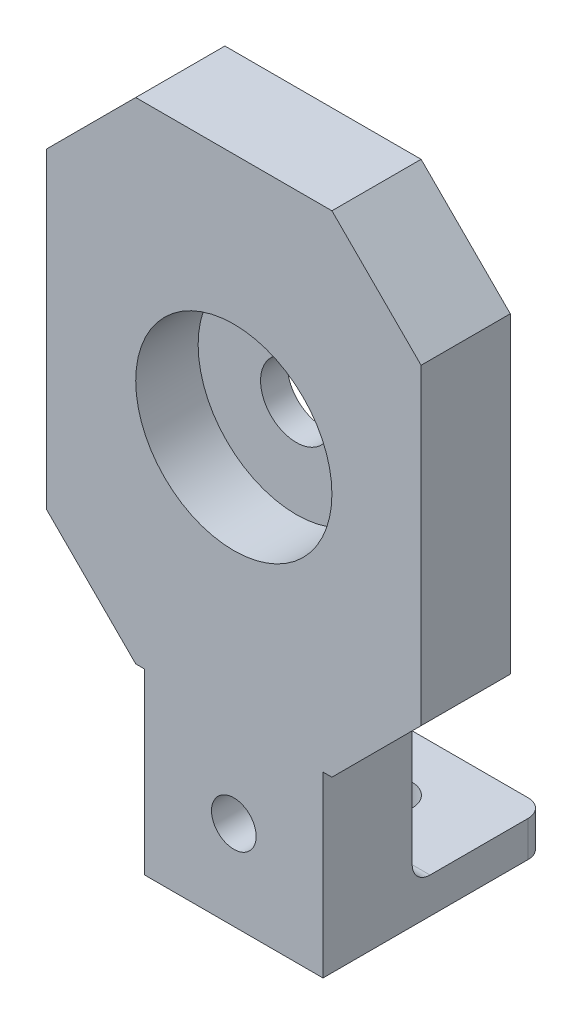
ISO-10303-21;
HEADER;
FILE_DESCRIPTION(('STEP AP214'),'2;1');
FILE_NAME('part.step','',(''),(''),'','','');
FILE_SCHEMA(('AUTOMOTIVE_DESIGN { 1 0 10303 214 1 1 1 1 }'));
ENDSEC;
DATA;
#1=APPLICATION_CONTEXT('core data for automotive mechanical design processes');
#2=APPLICATION_PROTOCOL_DEFINITION('international standard','automotive_design',2000,#1);
#3=PRODUCT_CONTEXT('',#1,'mechanical');
#4=PRODUCT('Part','Part','',(#3));
#5=PRODUCT_RELATED_PRODUCT_CATEGORY('part','',(#4));
#6=PRODUCT_DEFINITION_FORMATION('','',#4);
#7=PRODUCT_DEFINITION_CONTEXT('part definition',#1,'design');
#8=PRODUCT_DEFINITION('design','',#6,#7);
#9=PRODUCT_DEFINITION_SHAPE('','',#8);
#10=(LENGTH_UNIT() NAMED_UNIT(*) SI_UNIT(.MILLI.,.METRE.));
#11=(NAMED_UNIT(*) PLANE_ANGLE_UNIT() SI_UNIT($,.RADIAN.));
#12=(NAMED_UNIT(*) SI_UNIT($,.STERADIAN.) SOLID_ANGLE_UNIT());
#13=UNCERTAINTY_MEASURE_WITH_UNIT(LENGTH_MEASURE(1.E-05),#10,'distance_accuracy_value','');
#14=(GEOMETRIC_REPRESENTATION_CONTEXT(3) GLOBAL_UNCERTAINTY_ASSIGNED_CONTEXT((#13)) GLOBAL_UNIT_ASSIGNED_CONTEXT((#10,
#11,#12)) REPRESENTATION_CONTEXT('',''));
#15=CARTESIAN_POINT('',(0.,0.,0.));
#16=DIRECTION('',(0.,0.,1.));
#17=DIRECTION('',(1.,0.,0.));
#18=AXIS2_PLACEMENT_3D('',#15,#16,#17);
#19=CARTESIAN_POINT('',(21.,-27.5,10.));
#20=DIRECTION('',(-1.,0.,0.));
#21=DIRECTION('',(0.,-1.,0.));
#22=AXIS2_PLACEMENT_3D('',#19,#20,#21);
#23=PLANE('',#22);
#24=DIRECTION('',(0.,1.,0.));
#25=VECTOR('',#24,1.);
#26=CARTESIAN_POINT('',(21.,-27.5,10.));
#27=LINE('',#26,#25);
#28=CARTESIAN_POINT('',(21.,-17.5,10.));
#29=VERTEX_POINT('',#28);
#30=CARTESIAN_POINT('',(21.,17.5,10.));
#31=VERTEX_POINT('',#30);
#32=EDGE_CURVE('E209',#29,#31,#27,.T.);
#33=ORIENTED_EDGE('',*,*,#32,.F.);
#34=DIRECTION('',(0.,0.,-1.));
#35=VECTOR('',#34,1.);
#36=CARTESIAN_POINT('',(21.,-17.5,10.));
#37=LINE('',#36,#35);
#38=CARTESIAN_POINT('',(21.,-17.5,0.));
#39=VERTEX_POINT('',#38);
#40=EDGE_CURVE('E238',#29,#39,#37,.T.);
#41=ORIENTED_EDGE('',*,*,#40,.T.);
#42=DIRECTION('',(0.,1.,0.));
#43=VECTOR('',#42,1.);
#44=CARTESIAN_POINT('',(21.,-27.5,0.));
#45=LINE('',#44,#43);
#46=CARTESIAN_POINT('',(21.,17.5,0.));
#47=VERTEX_POINT('',#46);
#48=EDGE_CURVE('E191',#39,#47,#45,.T.);
#49=ORIENTED_EDGE('',*,*,#48,.T.);
#50=DIRECTION('',(0.,0.,1.));
#51=VECTOR('',#50,1.);
#52=CARTESIAN_POINT('',(21.,17.5,10.));
#53=LINE('',#52,#51);
#54=EDGE_CURVE('E236',#47,#31,#53,.T.);
#55=ORIENTED_EDGE('',*,*,#54,.T.);
#56=EDGE_LOOP('',(#33,#41,#49,#55));
#57=FACE_BOUND('',#56,.T.);
#58=ADVANCED_FACE('F35',(#57),#23,.F.);
#59=CARTESIAN_POINT('',(-21.,27.5,10.));
#60=DIRECTION('',(0.,-1.,0.));
#61=DIRECTION('',(1.,0.,0.));
#62=AXIS2_PLACEMENT_3D('',#59,#60,#61);
#63=PLANE('',#62);
#64=DIRECTION('',(-1.,0.,0.));
#65=VECTOR('',#64,1.);
#66=CARTESIAN_POINT('',(-21.,27.5,10.));
#67=LINE('',#66,#65);
#68=CARTESIAN_POINT('',(11.,27.5,10.));
#69=VERTEX_POINT('',#68);
#70=CARTESIAN_POINT('',(-11.,27.5,10.));
#71=VERTEX_POINT('',#70);
#72=EDGE_CURVE('E307',#69,#71,#67,.T.);
#73=ORIENTED_EDGE('',*,*,#72,.F.);
#74=DIRECTION('',(0.,0.,-1.));
#75=VECTOR('',#74,1.);
#76=CARTESIAN_POINT('',(11.,27.5,10.));
#77=LINE('',#76,#75);
#78=CARTESIAN_POINT('',(11.,27.5,0.));
#79=VERTEX_POINT('',#78);
#80=EDGE_CURVE('E245',#69,#79,#77,.T.);
#81=ORIENTED_EDGE('',*,*,#80,.T.);
#82=DIRECTION('',(-1.,0.,0.));
#83=VECTOR('',#82,1.);
#84=CARTESIAN_POINT('',(-21.,27.5,0.));
#85=LINE('',#84,#83);
#86=CARTESIAN_POINT('',(-11.,27.5,0.));
#87=VERTEX_POINT('',#86);
#88=EDGE_CURVE('E194',#79,#87,#85,.T.);
#89=ORIENTED_EDGE('',*,*,#88,.T.);
#90=DIRECTION('',(0.,0.,1.));
#91=VECTOR('',#90,1.);
#92=CARTESIAN_POINT('',(-11.,27.5,10.));
#93=LINE('',#92,#91);
#94=EDGE_CURVE('E243',#87,#71,#93,.T.);
#95=ORIENTED_EDGE('',*,*,#94,.T.);
#96=EDGE_LOOP('',(#73,#81,#89,#95));
#97=FACE_BOUND('',#96,.T.);
#98=ADVANCED_FACE('F324',(#97),#63,.F.);
#99=CARTESIAN_POINT('',(-21.,-27.5,10.));
#100=DIRECTION('',(1.,0.,0.));
#101=DIRECTION('',(0.,0.,-1.));
#102=AXIS2_PLACEMENT_3D('',#99,#100,#101);
#103=PLANE('',#102);
#104=DIRECTION('',(0.,-1.,0.));
#105=VECTOR('',#104,1.);
#106=CARTESIAN_POINT('',(-21.,-27.5,0.));
#107=LINE('',#106,#105);
#108=CARTESIAN_POINT('',(-21.,17.5,0.));
#109=VERTEX_POINT('',#108);
#110=CARTESIAN_POINT('',(-21.,-17.5,0.));
#111=VERTEX_POINT('',#110);
#112=EDGE_CURVE('E198',#109,#111,#107,.T.);
#113=ORIENTED_EDGE('',*,*,#112,.T.);
#114=DIRECTION('',(0.,0.,1.));
#115=VECTOR('',#114,1.);
#116=CARTESIAN_POINT('',(-21.,-17.5,10.));
#117=LINE('',#116,#115);
#118=CARTESIAN_POINT('',(-21.,-17.5,10.));
#119=VERTEX_POINT('',#118);
#120=EDGE_CURVE('E227',#111,#119,#117,.T.);
#121=ORIENTED_EDGE('',*,*,#120,.T.);
#122=DIRECTION('',(0.,-1.,0.));
#123=VECTOR('',#122,1.);
#124=CARTESIAN_POINT('',(-21.,-27.5,10.));
#125=LINE('',#124,#123);
#126=CARTESIAN_POINT('',(-21.,17.5,10.));
#127=VERTEX_POINT('',#126);
#128=EDGE_CURVE('E166',#127,#119,#125,.T.);
#129=ORIENTED_EDGE('',*,*,#128,.F.);
#130=DIRECTION('',(0.,0.,-1.));
#131=VECTOR('',#130,1.);
#132=CARTESIAN_POINT('',(-21.,17.5,10.));
#133=LINE('',#132,#131);
#134=EDGE_CURVE('E224',#127,#109,#133,.T.);
#135=ORIENTED_EDGE('',*,*,#134,.T.);
#136=EDGE_LOOP('',(#113,#121,#129,#135));
#137=FACE_BOUND('',#136,.T.);
#138=ADVANCED_FACE('F317',(#137),#103,.F.);
#139=CARTESIAN_POINT('',(-9.99999999999999,-27.5,10.));
#140=DIRECTION('',(0.,1.,0.));
#141=DIRECTION('',(0.,0.,1.));
#142=AXIS2_PLACEMENT_3D('',#139,#140,#141);
#143=PLANE('',#142);
#144=DIRECTION('',(1.,0.,0.));
#145=VECTOR('',#144,1.);
#146=CARTESIAN_POINT('',(-9.99999999999999,-27.5,10.));
#147=LINE('',#146,#145);
#148=CARTESIAN_POINT('',(-11.,-27.5,10.));
#149=VERTEX_POINT('',#148);
#150=CARTESIAN_POINT('',(-9.99999999999999,-27.5,10.));
#151=VERTEX_POINT('',#150);
#152=EDGE_CURVE('E155',#149,#151,#147,.T.);
#153=ORIENTED_EDGE('',*,*,#152,.F.);
#154=DIRECTION('',(0.,0.,-1.));
#155=VECTOR('',#154,1.);
#156=CARTESIAN_POINT('',(-11.,-27.5,10.));
#157=LINE('',#156,#155);
#158=CARTESIAN_POINT('',(-11.,-27.5,0.));
#159=VERTEX_POINT('',#158);
#160=EDGE_CURVE('E175',#149,#159,#157,.T.);
#161=ORIENTED_EDGE('',*,*,#160,.T.);
#162=DIRECTION('',(1.,0.,0.));
#163=VECTOR('',#162,1.);
#164=CARTESIAN_POINT('',(-9.99999999999999,-27.5,0.));
#165=LINE('',#164,#163);
#166=CARTESIAN_POINT('',(-9.99999999999999,-27.5,0.));
#167=VERTEX_POINT('',#166);
#168=EDGE_CURVE('E172',#159,#167,#165,.T.);
#169=ORIENTED_EDGE('',*,*,#168,.T.);
#170=DIRECTION('',(0.,0.,-1.));
#171=VECTOR('',#170,1.);
#172=CARTESIAN_POINT('',(-9.99999999999999,-27.5,10.));
#173=LINE('',#172,#171);
#174=EDGE_CURVE('E169',#151,#167,#173,.T.);
#175=ORIENTED_EDGE('',*,*,#174,.F.);
#176=EDGE_LOOP('',(#153,#161,#169,#175));
#177=FACE_BOUND('',#176,.T.);
#178=ADVANCED_FACE('F170',(#177),#143,.F.);
#179=CARTESIAN_POINT('',(-10.,-47.5,10.));
#180=DIRECTION('',(1.,0.,0.));
#181=DIRECTION('',(0.,1.,0.));
#182=AXIS2_PLACEMENT_3D('',#179,#180,#181);
#183=PLANE('',#182);
#184=DIRECTION('',(0.,0.,1.));
#185=VECTOR('',#184,1.);
#186=CARTESIAN_POINT('',(-9.99999999999999,-43.5,-15.));
#187=LINE('',#186,#185);
#188=CARTESIAN_POINT('',(-9.99999999999999,-43.5,-13.));
#189=VERTEX_POINT('',#188);
#190=CARTESIAN_POINT('',(-9.99999999999999,-43.5,-2.));
#191=VERTEX_POINT('',#190);
#192=EDGE_CURVE('E285',#189,#191,#187,.T.);
#193=ORIENTED_EDGE('',*,*,#192,.F.);
#194=DIRECTION('',(0.,1.,0.));
#195=VECTOR('',#194,1.);
#196=CARTESIAN_POINT('',(-10.,-47.5,-13.));
#197=LINE('',#196,#195);
#198=CARTESIAN_POINT('',(-10.,-47.5,-13.));
#199=VERTEX_POINT('',#198);
#200=EDGE_CURVE('E58',#189,#199,#197,.F.);
#201=ORIENTED_EDGE('',*,*,#200,.T.);
#202=DIRECTION('',(0.,0.,-1.));
#203=VECTOR('',#202,1.);
#204=CARTESIAN_POINT('',(-10.,-47.5,10.));
#205=LINE('',#204,#203);
#206=CARTESIAN_POINT('',(-10.,-47.5,10.));
#207=VERTEX_POINT('',#206);
#208=EDGE_CURVE('E176',#207,#199,#205,.T.);
#209=ORIENTED_EDGE('',*,*,#208,.F.);
#210=DIRECTION('',(0.,-1.,0.));
#211=VECTOR('',#210,1.);
#212=CARTESIAN_POINT('',(-10.,-47.5,10.));
#213=LINE('',#212,#211);
#214=EDGE_CURVE('E160',#151,#207,#213,.T.);
#215=ORIENTED_EDGE('',*,*,#214,.F.);
#216=ORIENTED_EDGE('',*,*,#174,.T.);
#217=DIRECTION('',(0.,-1.,0.));
#218=VECTOR('',#217,1.);
#219=CARTESIAN_POINT('',(-10.,-47.5,0.));
#220=LINE('',#219,#218);
#221=CARTESIAN_POINT('',(-10.,-41.5,0.));
#222=VERTEX_POINT('',#221);
#223=EDGE_CURVE('E202',#167,#222,#220,.T.);
#224=ORIENTED_EDGE('',*,*,#223,.T.);
#225=CARTESIAN_POINT('',(-10.,-41.5,-2.));
#226=DIRECTION('',(1.,0.,0.));
#227=DIRECTION('',(0.,1.,0.));
#228=AXIS2_PLACEMENT_3D('',#225,#226,#227);
#229=CIRCLE('',#228,2.);
#230=EDGE_CURVE('E11',#222,#191,#229,.T.);
#231=ORIENTED_EDGE('',*,*,#230,.T.);
#232=EDGE_LOOP('',(#193,#201,#209,#215,#216,#224,#231));
#233=FACE_BOUND('',#232,.T.);
#234=ADVANCED_FACE('F178',(#233),#183,.F.);
#235=CARTESIAN_POINT('',(-10.,-47.5,10.));
#236=DIRECTION('',(0.,1.,0.));
#237=DIRECTION('',(0.,0.,1.));
#238=AXIS2_PLACEMENT_3D('',#235,#236,#237);
#239=PLANE('',#238);
#240=CARTESIAN_POINT('',(0.,-47.5,-7.5));
#241=DIRECTION('',(0.,1.,0.));
#242=DIRECTION('',(0.,0.,1.));
#243=AXIS2_PLACEMENT_3D('',#240,#241,#242);
#244=CIRCLE('',#243,2.5);
#245=CARTESIAN_POINT('',(0.,-47.5,-5.));
#246=VERTEX_POINT('',#245);
#247=EDGE_CURVE('E401',#246,#246,#244,.T.);
#248=ORIENTED_EDGE('',*,*,#247,.T.);
#249=EDGE_LOOP('',(#248));
#250=FACE_BOUND('',#249,.T.);
#251=ORIENTED_EDGE('',*,*,#208,.T.);
#252=CARTESIAN_POINT('',(-8.,-47.5,-13.));
#253=DIRECTION('',(0.,1.,0.));
#254=DIRECTION('',(0.,0.,1.));
#255=AXIS2_PLACEMENT_3D('',#252,#253,#254);
#256=CIRCLE('',#255,2.);
#257=CARTESIAN_POINT('',(-7.99999999999999,-47.5,-15.));
#258=VERTEX_POINT('',#257);
#259=EDGE_CURVE('E265',#199,#258,#256,.F.);
#260=ORIENTED_EDGE('',*,*,#259,.T.);
#261=DIRECTION('',(-1.,0.,0.));
#262=VECTOR('',#261,1.);
#263=CARTESIAN_POINT('',(10.,-47.5,-15.));
#264=LINE('',#263,#262);
#265=CARTESIAN_POINT('',(8.00000000000001,-47.5,-15.));
#266=VERTEX_POINT('',#265);
#267=EDGE_CURVE('E396',#266,#258,#264,.T.);
#268=ORIENTED_EDGE('',*,*,#267,.F.);
#269=CARTESIAN_POINT('',(8.00000000000001,-47.5,-13.));
#270=DIRECTION('',(0.,1.,0.));
#271=DIRECTION('',(0.,0.,1.));
#272=AXIS2_PLACEMENT_3D('',#269,#270,#271);
#273=CIRCLE('',#272,2.);
#274=CARTESIAN_POINT('',(10.,-47.5,-13.));
#275=VERTEX_POINT('',#274);
#276=EDGE_CURVE('E50',#266,#275,#273,.F.);
#277=ORIENTED_EDGE('',*,*,#276,.T.);
#278=DIRECTION('',(0.,0.,-1.));
#279=VECTOR('',#278,1.);
#280=CARTESIAN_POINT('',(10.,-47.5,10.));
#281=LINE('',#280,#279);
#282=CARTESIAN_POINT('',(10.,-47.5,10.));
#283=VERTEX_POINT('',#282);
#284=EDGE_CURVE('E212',#283,#275,#281,.T.);
#285=ORIENTED_EDGE('',*,*,#284,.F.);
#286=DIRECTION('',(1.,0.,0.));
#287=VECTOR('',#286,1.);
#288=CARTESIAN_POINT('',(-10.,-47.5,10.));
#289=LINE('',#288,#287);
#290=EDGE_CURVE('E180',#207,#283,#289,.T.);
#291=ORIENTED_EDGE('',*,*,#290,.F.);
#292=EDGE_LOOP('',(#251,#260,#268,#277,#285,#291));
#293=FACE_BOUND('',#292,.T.);
#294=ADVANCED_FACE('F343',(#250,#293),#239,.F.);
#295=CARTESIAN_POINT('',(10.,-47.5,10.));
#296=DIRECTION('',(-1.,0.,0.));
#297=DIRECTION('',(0.,-1.,0.));
#298=AXIS2_PLACEMENT_3D('',#295,#296,#297);
#299=PLANE('',#298);
#300=ORIENTED_EDGE('',*,*,#284,.T.);
#301=DIRECTION('',(0.,-1.,0.));
#302=VECTOR('',#301,1.);
#303=CARTESIAN_POINT('',(10.,-47.5,-13.));
#304=LINE('',#303,#302);
#305=CARTESIAN_POINT('',(10.,-43.5,-13.));
#306=VERTEX_POINT('',#305);
#307=EDGE_CURVE('E267',#275,#306,#304,.F.);
#308=ORIENTED_EDGE('',*,*,#307,.T.);
#309=DIRECTION('',(0.,0.,1.));
#310=VECTOR('',#309,1.);
#311=CARTESIAN_POINT('',(10.,-43.5,-15.));
#312=LINE('',#311,#310);
#313=CARTESIAN_POINT('',(10.,-43.5,-2.));
#314=VERTEX_POINT('',#313);
#315=EDGE_CURVE('E274',#306,#314,#312,.T.);
#316=ORIENTED_EDGE('',*,*,#315,.T.);
#317=CARTESIAN_POINT('',(10.,-41.5,-2.));
#318=DIRECTION('',(-1.,0.,0.));
#319=DIRECTION('',(0.,-1.,0.));
#320=AXIS2_PLACEMENT_3D('',#317,#318,#319);
#321=CIRCLE('',#320,2.);
#322=CARTESIAN_POINT('',(10.,-41.5,0.));
#323=VERTEX_POINT('',#322);
#324=EDGE_CURVE('E43',#314,#323,#321,.T.);
#325=ORIENTED_EDGE('',*,*,#324,.T.);
#326=DIRECTION('',(0.,1.,0.));
#327=VECTOR('',#326,1.);
#328=CARTESIAN_POINT('',(10.,-47.5,0.));
#329=LINE('',#328,#327);
#330=CARTESIAN_POINT('',(10.,-27.5,0.));
#331=VERTEX_POINT('',#330);
#332=EDGE_CURVE('E204',#323,#331,#329,.T.);
#333=ORIENTED_EDGE('',*,*,#332,.T.);
#334=DIRECTION('',(0.,0.,-1.));
#335=VECTOR('',#334,1.);
#336=CARTESIAN_POINT('',(10.,-27.5,10.));
#337=LINE('',#336,#335);
#338=CARTESIAN_POINT('',(10.,-27.5,10.));
#339=VERTEX_POINT('',#338);
#340=EDGE_CURVE('E190',#339,#331,#337,.T.);
#341=ORIENTED_EDGE('',*,*,#340,.F.);
#342=DIRECTION('',(0.,1.,0.));
#343=VECTOR('',#342,1.);
#344=CARTESIAN_POINT('',(10.,-47.5,10.));
#345=LINE('',#344,#343);
#346=EDGE_CURVE('E182',#283,#339,#345,.T.);
#347=ORIENTED_EDGE('',*,*,#346,.F.);
#348=EDGE_LOOP('',(#300,#308,#316,#325,#333,#341,#347));
#349=FACE_BOUND('',#348,.T.);
#350=ADVANCED_FACE('F271',(#349),#299,.F.);
#351=CARTESIAN_POINT('',(10.,-27.5,10.));
#352=DIRECTION('',(0.,1.,0.));
#353=DIRECTION('',(0.,0.,1.));
#354=AXIS2_PLACEMENT_3D('',#351,#352,#353);
#355=PLANE('',#354);
#356=DIRECTION('',(1.,0.,0.));
#357=VECTOR('',#356,1.);
#358=CARTESIAN_POINT('',(10.,-27.5,0.));
#359=LINE('',#358,#357);
#360=CARTESIAN_POINT('',(11.,-27.5,0.));
#361=VERTEX_POINT('',#360);
#362=EDGE_CURVE('E206',#331,#361,#359,.T.);
#363=ORIENTED_EDGE('',*,*,#362,.T.);
#364=DIRECTION('',(0.,0.,1.));
#365=VECTOR('',#364,1.);
#366=CARTESIAN_POINT('',(11.,-27.5,10.));
#367=LINE('',#366,#365);
#368=CARTESIAN_POINT('',(11.,-27.5,10.));
#369=VERTEX_POINT('',#368);
#370=EDGE_CURVE('E241',#361,#369,#367,.T.);
#371=ORIENTED_EDGE('',*,*,#370,.T.);
#372=DIRECTION('',(1.,0.,0.));
#373=VECTOR('',#372,1.);
#374=CARTESIAN_POINT('',(10.,-27.5,10.));
#375=LINE('',#374,#373);
#376=EDGE_CURVE('E187',#339,#369,#375,.T.);
#377=ORIENTED_EDGE('',*,*,#376,.F.);
#378=ORIENTED_EDGE('',*,*,#340,.T.);
#379=EDGE_LOOP('',(#363,#371,#377,#378));
#380=FACE_BOUND('',#379,.T.);
#381=ADVANCED_FACE('F339',(#380),#355,.F.);
#382=CARTESIAN_POINT('',(0.,0.,10.));
#383=DIRECTION('',(0.,0.,-1.));
#384=DIRECTION('',(-1.,0.,0.));
#385=AXIS2_PLACEMENT_3D('',#382,#383,#384);
#386=PLANE('',#385);
#387=CARTESIAN_POINT('',(0.,-37.5,10.));
#388=DIRECTION('',(0.,0.,-1.));
#389=DIRECTION('',(-1.,0.,0.));
#390=AXIS2_PLACEMENT_3D('',#387,#388,#389);
#391=CIRCLE('',#390,2.5);
#392=CARTESIAN_POINT('',(-2.5,-37.5,10.));
#393=VERTEX_POINT('',#392);
#394=EDGE_CURVE('E408',#393,#393,#391,.T.);
#395=ORIENTED_EDGE('',*,*,#394,.T.);
#396=EDGE_LOOP('',(#395));
#397=FACE_BOUND('',#396,.T.);
#398=CARTESIAN_POINT('',(0.,0.,10.));
#399=DIRECTION('',(0.,0.,1.));
#400=DIRECTION('',(1.,0.,0.));
#401=AXIS2_PLACEMENT_3D('',#398,#399,#400);
#402=CIRCLE('',#401,11.);
#403=CARTESIAN_POINT('',(11.,0.,10.));
#404=VERTEX_POINT('',#403);
#405=EDGE_CURVE('E299',#404,#404,#402,.T.);
#406=ORIENTED_EDGE('',*,*,#405,.F.);
#407=EDGE_LOOP('',(#406));
#408=FACE_BOUND('',#407,.T.);
#409=ORIENTED_EDGE('',*,*,#128,.T.);
#410=DIRECTION('',(-0.707106781186546,0.707106781186549,0.));
#411=VECTOR('',#410,1.);
#412=CARTESIAN_POINT('',(-11.,-27.5,10.));
#413=LINE('',#412,#411);
#414=EDGE_CURVE('E162',#119,#149,#413,.F.);
#415=ORIENTED_EDGE('',*,*,#414,.T.);
#416=ORIENTED_EDGE('',*,*,#152,.T.);
#417=ORIENTED_EDGE('',*,*,#214,.T.);
#418=ORIENTED_EDGE('',*,*,#290,.T.);
#419=ORIENTED_EDGE('',*,*,#346,.T.);
#420=ORIENTED_EDGE('',*,*,#376,.T.);
#421=DIRECTION('',(-0.707106781186548,-0.707106781186547,0.));
#422=VECTOR('',#421,1.);
#423=CARTESIAN_POINT('',(21.,-17.5,10.));
#424=LINE('',#423,#422);
#425=EDGE_CURVE('E233',#369,#29,#424,.F.);
#426=ORIENTED_EDGE('',*,*,#425,.T.);
#427=ORIENTED_EDGE('',*,*,#32,.T.);
#428=DIRECTION('',(0.707106781186547,-0.707106781186548,0.));
#429=VECTOR('',#428,1.);
#430=CARTESIAN_POINT('',(11.,27.5,10.));
#431=LINE('',#430,#429);
#432=EDGE_CURVE('E231',#31,#69,#431,.F.);
#433=ORIENTED_EDGE('',*,*,#432,.T.);
#434=ORIENTED_EDGE('',*,*,#72,.T.);
#435=DIRECTION('',(0.707106781186549,0.707106781186546,0.));
#436=VECTOR('',#435,1.);
#437=CARTESIAN_POINT('',(-21.,17.5,10.));
#438=LINE('',#437,#436);
#439=EDGE_CURVE('E229',#71,#127,#438,.F.);
#440=ORIENTED_EDGE('',*,*,#439,.T.);
#441=EDGE_LOOP('',(#409,#415,#416,#417,#418,#419,#420,#426,#427,#433,#434,#440));
#442=FACE_BOUND('',#441,.T.);
#443=ADVANCED_FACE('F158',(#397,#408,#442),#386,.F.);
#444=CARTESIAN_POINT('',(0.,0.,0.));
#445=DIRECTION('',(0.,0.,-1.));
#446=DIRECTION('',(-1.,0.,0.));
#447=AXIS2_PLACEMENT_3D('',#444,#445,#446);
#448=PLANE('',#447);
#449=CARTESIAN_POINT('',(0.,-37.5,0.));
#450=DIRECTION('',(0.,0.,-1.));
#451=DIRECTION('',(-1.,0.,0.));
#452=AXIS2_PLACEMENT_3D('',#449,#450,#451);
#453=CIRCLE('',#452,2.5);
#454=CARTESIAN_POINT('',(-2.5,-37.5,0.));
#455=VERTEX_POINT('',#454);
#456=EDGE_CURVE('E409',#455,#455,#453,.T.);
#457=ORIENTED_EDGE('',*,*,#456,.F.);
#458=EDGE_LOOP('',(#457));
#459=FACE_BOUND('',#458,.T.);
#460=ORIENTED_EDGE('',*,*,#332,.F.);
#461=DIRECTION('',(1.,0.,0.));
#462=VECTOR('',#461,1.);
#463=CARTESIAN_POINT('',(0.,-41.5,0.));
#464=LINE('',#463,#462);
#465=EDGE_CURVE('E255',#323,#222,#464,.F.);
#466=ORIENTED_EDGE('',*,*,#465,.T.);
#467=ORIENTED_EDGE('',*,*,#223,.F.);
#468=ORIENTED_EDGE('',*,*,#168,.F.);
#469=DIRECTION('',(0.707106781186546,-0.707106781186549,0.));
#470=VECTOR('',#469,1.);
#471=CARTESIAN_POINT('',(-19.25,-19.25,0.));
#472=LINE('',#471,#470);
#473=EDGE_CURVE('E222',#159,#111,#472,.F.);
#474=ORIENTED_EDGE('',*,*,#473,.T.);
#475=ORIENTED_EDGE('',*,*,#112,.F.);
#476=DIRECTION('',(-0.707106781186549,-0.707106781186546,0.));
#477=VECTOR('',#476,1.);
#478=CARTESIAN_POINT('',(-19.25,19.25,0.));
#479=LINE('',#478,#477);
#480=EDGE_CURVE('E216',#109,#87,#479,.F.);
#481=ORIENTED_EDGE('',*,*,#480,.T.);
#482=ORIENTED_EDGE('',*,*,#88,.F.);
#483=DIRECTION('',(-0.707106781186547,0.707106781186548,0.));
#484=VECTOR('',#483,1.);
#485=CARTESIAN_POINT('',(19.25,19.25,0.));
#486=LINE('',#485,#484);
#487=EDGE_CURVE('E218',#79,#47,#486,.F.);
#488=ORIENTED_EDGE('',*,*,#487,.T.);
#489=ORIENTED_EDGE('',*,*,#48,.F.);
#490=DIRECTION('',(0.707106781186548,0.707106781186547,0.));
#491=VECTOR('',#490,1.);
#492=CARTESIAN_POINT('',(19.25,-19.25,0.));
#493=LINE('',#492,#491);
#494=EDGE_CURVE('E220',#39,#361,#493,.F.);
#495=ORIENTED_EDGE('',*,*,#494,.T.);
#496=ORIENTED_EDGE('',*,*,#362,.F.);
#497=EDGE_LOOP('',(#460,#466,#467,#468,#474,#475,#481,#482,#488,#489,#495,#496));
#498=FACE_BOUND('',#497,.T.);
#499=CARTESIAN_POINT('',(0.,0.,0.));
#500=DIRECTION('',(0.,0.,1.));
#501=DIRECTION('',(1.,0.,0.));
#502=AXIS2_PLACEMENT_3D('',#499,#500,#501);
#503=CIRCLE('',#502,4.);
#504=CARTESIAN_POINT('',(4.,0.,0.));
#505=VERTEX_POINT('',#504);
#506=EDGE_CURVE('E292',#505,#505,#503,.T.);
#507=ORIENTED_EDGE('',*,*,#506,.T.);
#508=EDGE_LOOP('',(#507));
#509=FACE_BOUND('',#508,.T.);
#510=ADVANCED_FACE('F280',(#459,#498,#509),#448,.T.);
#511=CARTESIAN_POINT('',(0.,0.,3.));
#512=DIRECTION('',(0.,0.,1.));
#513=DIRECTION('',(1.,0.,0.));
#514=AXIS2_PLACEMENT_3D('',#511,#512,#513);
#515=CYLINDRICAL_SURFACE('',#514,11.);
#516=CARTESIAN_POINT('',(0.,0.,3.));
#517=DIRECTION('',(0.,0.,1.));
#518=DIRECTION('',(1.,0.,0.));
#519=AXIS2_PLACEMENT_3D('',#516,#517,#518);
#520=CIRCLE('',#519,11.);
#521=CARTESIAN_POINT('',(11.,0.,3.));
#522=VERTEX_POINT('',#521);
#523=EDGE_CURVE('E195',#522,#522,#520,.T.);
#524=ORIENTED_EDGE('',*,*,#523,.F.);
#525=EDGE_LOOP('',(#524));
#526=FACE_BOUND('',#525,.T.);
#527=ORIENTED_EDGE('',*,*,#405,.T.);
#528=EDGE_LOOP('',(#527));
#529=FACE_BOUND('',#528,.T.);
#530=ADVANCED_FACE('F423',(#526,#529),#515,.F.);
#531=CARTESIAN_POINT('',(0.,0.,3.));
#532=DIRECTION('',(0.,0.,1.));
#533=DIRECTION('',(1.,0.,0.));
#534=AXIS2_PLACEMENT_3D('',#531,#532,#533);
#535=PLANE('',#534);
#536=CARTESIAN_POINT('',(0.,0.,3.));
#537=DIRECTION('',(0.,0.,1.));
#538=DIRECTION('',(1.,0.,0.));
#539=AXIS2_PLACEMENT_3D('',#536,#537,#538);
#540=CIRCLE('',#539,4.);
#541=CARTESIAN_POINT('',(4.,0.,3.));
#542=VERTEX_POINT('',#541);
#543=EDGE_CURVE('E289',#542,#542,#540,.T.);
#544=ORIENTED_EDGE('',*,*,#543,.F.);
#545=EDGE_LOOP('',(#544));
#546=FACE_BOUND('',#545,.T.);
#547=ORIENTED_EDGE('',*,*,#523,.T.);
#548=EDGE_LOOP('',(#547));
#549=FACE_BOUND('',#548,.T.);
#550=ADVANCED_FACE('F429',(#546,#549),#535,.T.);
#551=CARTESIAN_POINT('',(0.,0.,0.));
#552=DIRECTION('',(0.,0.,1.));
#553=DIRECTION('',(1.,0.,0.));
#554=AXIS2_PLACEMENT_3D('',#551,#552,#553);
#555=CYLINDRICAL_SURFACE('',#554,4.);
#556=ORIENTED_EDGE('',*,*,#506,.F.);
#557=EDGE_LOOP('',(#556));
#558=FACE_BOUND('',#557,.T.);
#559=ORIENTED_EDGE('',*,*,#543,.T.);
#560=EDGE_LOOP('',(#559));
#561=FACE_BOUND('',#560,.T.);
#562=ADVANCED_FACE('F369',(#558,#561),#555,.F.);
#563=CARTESIAN_POINT('',(-11.,-27.5,10.));
#564=DIRECTION('',(0.707106781186549,0.707106781186546,0.));
#565=DIRECTION('',(0.,0.,-1.));
#566=AXIS2_PLACEMENT_3D('',#563,#564,#565);
#567=PLANE('',#566);
#568=ORIENTED_EDGE('',*,*,#414,.F.);
#569=ORIENTED_EDGE('',*,*,#120,.F.);
#570=ORIENTED_EDGE('',*,*,#473,.F.);
#571=ORIENTED_EDGE('',*,*,#160,.F.);
#572=EDGE_LOOP('',(#568,#569,#570,#571));
#573=FACE_BOUND('',#572,.T.);
#574=ADVANCED_FACE('F315',(#573),#567,.F.);
#575=CARTESIAN_POINT('',(21.,-17.5,10.));
#576=DIRECTION('',(-0.707106781186547,0.707106781186548,0.));
#577=DIRECTION('',(0.,0.,-1.));
#578=AXIS2_PLACEMENT_3D('',#575,#576,#577);
#579=PLANE('',#578);
#580=ORIENTED_EDGE('',*,*,#425,.F.);
#581=ORIENTED_EDGE('',*,*,#370,.F.);
#582=ORIENTED_EDGE('',*,*,#494,.F.);
#583=ORIENTED_EDGE('',*,*,#40,.F.);
#584=EDGE_LOOP('',(#580,#581,#582,#583));
#585=FACE_BOUND('',#584,.T.);
#586=ADVANCED_FACE('F336',(#585),#579,.F.);
#587=CARTESIAN_POINT('',(11.,27.5,10.));
#588=DIRECTION('',(-0.707106781186548,-0.707106781186547,0.));
#589=DIRECTION('',(0.,0.,-1.));
#590=AXIS2_PLACEMENT_3D('',#587,#588,#589);
#591=PLANE('',#590);
#592=ORIENTED_EDGE('',*,*,#432,.F.);
#593=ORIENTED_EDGE('',*,*,#54,.F.);
#594=ORIENTED_EDGE('',*,*,#487,.F.);
#595=ORIENTED_EDGE('',*,*,#80,.F.);
#596=EDGE_LOOP('',(#592,#593,#594,#595));
#597=FACE_BOUND('',#596,.T.);
#598=ADVANCED_FACE('F328',(#597),#591,.F.);
#599=CARTESIAN_POINT('',(-21.,17.5,10.));
#600=DIRECTION('',(0.707106781186546,-0.707106781186549,0.));
#601=DIRECTION('',(0.,0.,-1.));
#602=AXIS2_PLACEMENT_3D('',#599,#600,#601);
#603=PLANE('',#602);
#604=ORIENTED_EDGE('',*,*,#439,.F.);
#605=ORIENTED_EDGE('',*,*,#94,.F.);
#606=ORIENTED_EDGE('',*,*,#480,.F.);
#607=ORIENTED_EDGE('',*,*,#134,.F.);
#608=EDGE_LOOP('',(#604,#605,#606,#607));
#609=FACE_BOUND('',#608,.T.);
#610=ADVANCED_FACE('F319',(#609),#603,.F.);
#611=CARTESIAN_POINT('',(10.,-43.5,-15.));
#612=DIRECTION('',(0.,-1.,0.));
#613=DIRECTION('',(0.,0.,-1.));
#614=AXIS2_PLACEMENT_3D('',#611,#612,#613);
#615=PLANE('',#614);
#616=CARTESIAN_POINT('',(0.,-43.5,-7.5));
#617=DIRECTION('',(0.,1.,0.));
#618=DIRECTION('',(0.,0.,1.));
#619=AXIS2_PLACEMENT_3D('',#616,#617,#618);
#620=CIRCLE('',#619,2.5);
#621=CARTESIAN_POINT('',(0.,-43.5,-5.));
#622=VERTEX_POINT('',#621);
#623=EDGE_CURVE('E403',#622,#622,#620,.T.);
#624=ORIENTED_EDGE('',*,*,#623,.F.);
#625=EDGE_LOOP('',(#624));
#626=FACE_BOUND('',#625,.T.);
#627=ORIENTED_EDGE('',*,*,#192,.T.);
#628=DIRECTION('',(1.,0.,0.));
#629=VECTOR('',#628,1.);
#630=CARTESIAN_POINT('',(10.,-43.5,-2.));
#631=LINE('',#630,#629);
#632=EDGE_CURVE('E252',#191,#314,#631,.T.);
#633=ORIENTED_EDGE('',*,*,#632,.T.);
#634=ORIENTED_EDGE('',*,*,#315,.F.);
#635=CARTESIAN_POINT('',(8.00000000000001,-43.5,-13.));
#636=DIRECTION('',(0.,-1.,0.));
#637=DIRECTION('',(0.,0.,-1.));
#638=AXIS2_PLACEMENT_3D('',#635,#636,#637);
#639=CIRCLE('',#638,2.);
#640=CARTESIAN_POINT('',(8.00000000000001,-43.5,-15.));
#641=VERTEX_POINT('',#640);
#642=EDGE_CURVE('E248',#306,#641,#639,.F.);
#643=ORIENTED_EDGE('',*,*,#642,.T.);
#644=DIRECTION('',(1.,0.,0.));
#645=VECTOR('',#644,1.);
#646=CARTESIAN_POINT('',(10.,-43.5,-15.));
#647=LINE('',#646,#645);
#648=CARTESIAN_POINT('',(-7.99999999999999,-43.5,-15.));
#649=VERTEX_POINT('',#648);
#650=EDGE_CURVE('E294',#649,#641,#647,.T.);
#651=ORIENTED_EDGE('',*,*,#650,.F.);
#652=CARTESIAN_POINT('',(-8.,-43.5,-13.));
#653=DIRECTION('',(0.,-1.,0.));
#654=DIRECTION('',(0.,0.,-1.));
#655=AXIS2_PLACEMENT_3D('',#652,#653,#654);
#656=CIRCLE('',#655,2.);
#657=EDGE_CURVE('E250',#649,#189,#656,.F.);
#658=ORIENTED_EDGE('',*,*,#657,.T.);
#659=EDGE_LOOP('',(#627,#633,#634,#643,#651,#658));
#660=FACE_BOUND('',#659,.T.);
#661=ADVANCED_FACE('F287',(#626,#660),#615,.F.);
#662=CARTESIAN_POINT('',(0.,0.,-15.));
#663=DIRECTION('',(0.,0.,1.));
#664=DIRECTION('',(1.,0.,0.));
#665=AXIS2_PLACEMENT_3D('',#662,#663,#664);
#666=PLANE('',#665);
#667=ORIENTED_EDGE('',*,*,#267,.T.);
#668=DIRECTION('',(0.,1.,0.));
#669=VECTOR('',#668,1.);
#670=CARTESIAN_POINT('',(-7.99999999999999,0.,-15.));
#671=LINE('',#670,#669);
#672=EDGE_CURVE('E260',#258,#649,#671,.T.);
#673=ORIENTED_EDGE('',*,*,#672,.T.);
#674=ORIENTED_EDGE('',*,*,#650,.T.);
#675=DIRECTION('',(0.,-1.,0.));
#676=VECTOR('',#675,1.);
#677=CARTESIAN_POINT('',(7.99999999999999,0.,-15.));
#678=LINE('',#677,#676);
#679=EDGE_CURVE('E257',#641,#266,#678,.T.);
#680=ORIENTED_EDGE('',*,*,#679,.T.);
#681=EDGE_LOOP('',(#667,#673,#674,#680));
#682=FACE_BOUND('',#681,.T.);
#683=ADVANCED_FACE('F398',(#682),#666,.F.);
#684=CARTESIAN_POINT('',(0.,-78.5,-7.5));
#685=DIRECTION('',(0.,1.,0.));
#686=DIRECTION('',(0.,0.,1.));
#687=AXIS2_PLACEMENT_3D('',#684,#685,#686);
#688=CYLINDRICAL_SURFACE('',#687,2.5);
#689=ORIENTED_EDGE('',*,*,#623,.T.);
#690=EDGE_LOOP('',(#689));
#691=FACE_BOUND('',#690,.T.);
#692=ORIENTED_EDGE('',*,*,#247,.F.);
#693=EDGE_LOOP('',(#692));
#694=FACE_BOUND('',#693,.T.);
#695=ADVANCED_FACE('F386',(#691,#694),#688,.F.);
#696=CARTESIAN_POINT('',(10.,-41.5,-2.));
#697=DIRECTION('',(1.,0.,0.));
#698=DIRECTION('',(0.,0.,-1.));
#699=AXIS2_PLACEMENT_3D('',#696,#697,#698);
#700=CYLINDRICAL_SURFACE('',#699,2.);
#701=ORIENTED_EDGE('',*,*,#230,.F.);
#702=ORIENTED_EDGE('',*,*,#465,.F.);
#703=ORIENTED_EDGE('',*,*,#324,.F.);
#704=ORIENTED_EDGE('',*,*,#632,.F.);
#705=EDGE_LOOP('',(#701,#702,#703,#704));
#706=FACE_BOUND('',#705,.T.);
#707=ADVANCED_FACE('F283',(#706),#700,.F.);
#708=CARTESIAN_POINT('',(-7.99999999999999,0.,-13.));
#709=DIRECTION('',(0.,1.,0.));
#710=DIRECTION('',(-1.,0.,0.));
#711=AXIS2_PLACEMENT_3D('',#708,#709,#710);
#712=CYLINDRICAL_SURFACE('',#711,2.);
#713=ORIENTED_EDGE('',*,*,#259,.F.);
#714=ORIENTED_EDGE('',*,*,#200,.F.);
#715=ORIENTED_EDGE('',*,*,#657,.F.);
#716=ORIENTED_EDGE('',*,*,#672,.F.);
#717=EDGE_LOOP('',(#713,#714,#715,#716));
#718=FACE_BOUND('',#717,.T.);
#719=ADVANCED_FACE('F385',(#718),#712,.T.);
#720=CARTESIAN_POINT('',(7.99999999999999,0.,-13.));
#721=DIRECTION('',(0.,-1.,0.));
#722=DIRECTION('',(1.,0.,0.));
#723=AXIS2_PLACEMENT_3D('',#720,#721,#722);
#724=CYLINDRICAL_SURFACE('',#723,2.);
#725=ORIENTED_EDGE('',*,*,#642,.F.);
#726=ORIENTED_EDGE('',*,*,#307,.F.);
#727=ORIENTED_EDGE('',*,*,#276,.F.);
#728=ORIENTED_EDGE('',*,*,#679,.F.);
#729=EDGE_LOOP('',(#725,#726,#727,#728));
#730=FACE_BOUND('',#729,.T.);
#731=ADVANCED_FACE('F37',(#730),#724,.T.);
#732=CARTESIAN_POINT('',(0.,-37.5,10.));
#733=DIRECTION('',(0.,0.,-1.));
#734=DIRECTION('',(-1.,0.,0.));
#735=AXIS2_PLACEMENT_3D('',#732,#733,#734);
#736=CYLINDRICAL_SURFACE('',#735,2.5);
#737=ORIENTED_EDGE('',*,*,#394,.F.);
#738=EDGE_LOOP('',(#737));
#739=FACE_BOUND('',#738,.T.);
#740=ORIENTED_EDGE('',*,*,#456,.T.);
#741=EDGE_LOOP('',(#740));
#742=FACE_BOUND('',#741,.T.);
#743=ADVANCED_FACE('F392',(#739,#742),#736,.F.);
#744=CLOSED_SHELL('',(#58,#98,#138,#178,#234,#294,#350,#381,#443,#510,#530,#550,#562,#574,#586,
#598,#610,#661,#683,#695,#707,#719,#731,#743));
#745=MANIFOLD_SOLID_BREP('B2',#744);
#746=ADVANCED_BREP_SHAPE_REPRESENTATION('',(#18,#745),#14);
#747=SHAPE_DEFINITION_REPRESENTATION(#9,#746);
ENDSEC;
END-ISO-10303-21;
